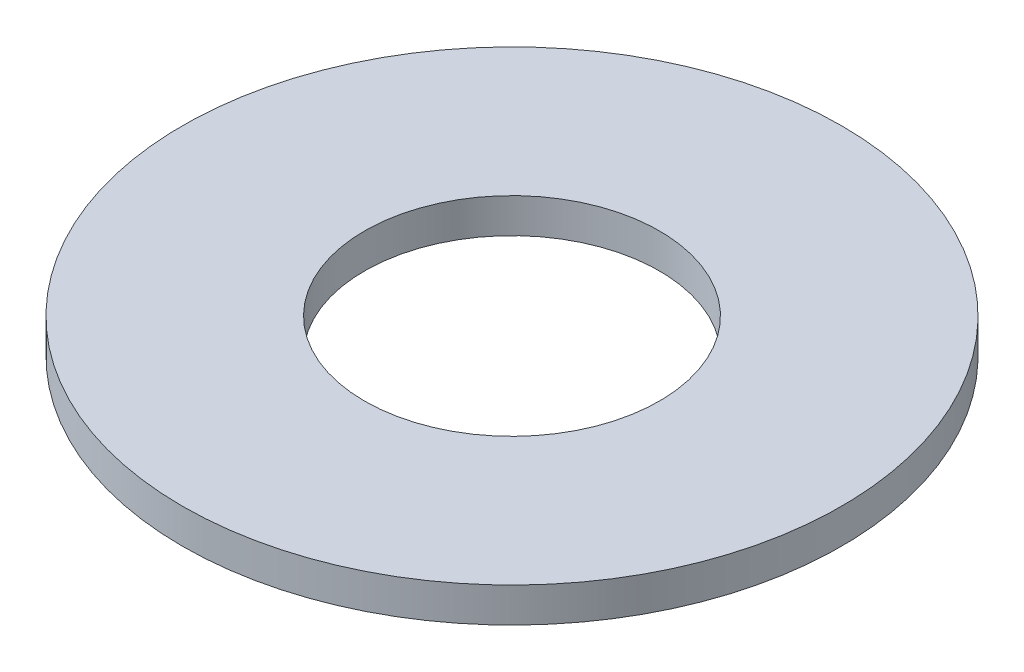
ISO-10303-21;
HEADER;
FILE_DESCRIPTION(('STEP AP214'),'2;1');
FILE_NAME('part.step','',(''),(''),'','','');
FILE_SCHEMA(('AUTOMOTIVE_DESIGN { 1 0 10303 214 1 1 1 1 }'));
ENDSEC;
DATA;
#1=APPLICATION_CONTEXT('core data for automotive mechanical design processes');
#2=APPLICATION_PROTOCOL_DEFINITION('international standard','automotive_design',2000,#1);
#3=PRODUCT_CONTEXT('',#1,'mechanical');
#4=PRODUCT('Part','Part','',(#3));
#5=PRODUCT_RELATED_PRODUCT_CATEGORY('part','',(#4));
#6=PRODUCT_DEFINITION_FORMATION('','',#4);
#7=PRODUCT_DEFINITION_CONTEXT('part definition',#1,'design');
#8=PRODUCT_DEFINITION('design','',#6,#7);
#9=PRODUCT_DEFINITION_SHAPE('','',#8);
#10=(LENGTH_UNIT() NAMED_UNIT(*) SI_UNIT(.MILLI.,.METRE.));
#11=(NAMED_UNIT(*) PLANE_ANGLE_UNIT() SI_UNIT($,.RADIAN.));
#12=(NAMED_UNIT(*) SI_UNIT($,.STERADIAN.) SOLID_ANGLE_UNIT());
#13=UNCERTAINTY_MEASURE_WITH_UNIT(LENGTH_MEASURE(1.E-05),#10,'distance_accuracy_value','');
#14=(GEOMETRIC_REPRESENTATION_CONTEXT(3) GLOBAL_UNCERTAINTY_ASSIGNED_CONTEXT((#13)) GLOBAL_UNIT_ASSIGNED_CONTEXT((#10,
#11,#12)) REPRESENTATION_CONTEXT('',''));
#15=CARTESIAN_POINT('',(0.,0.,0.));
#16=DIRECTION('',(0.,0.,1.));
#17=DIRECTION('',(1.,0.,0.));
#18=AXIS2_PLACEMENT_3D('',#15,#16,#17);
#19=CARTESIAN_POINT('',(0.,0.508,0.));
#20=DIRECTION('',(0.,1.,0.));
#21=DIRECTION('',(0.,0.,1.));
#22=AXIS2_PLACEMENT_3D('',#19,#20,#21);
#23=PLANE('',#22);
#24=CARTESIAN_POINT('',(0.,0.508,0.));
#25=DIRECTION('',(0.,1.,0.));
#26=DIRECTION('',(0.,0.,1.));
#27=AXIS2_PLACEMENT_3D('',#24,#25,#26);
#28=CIRCLE('',#27,4.826);
#29=CARTESIAN_POINT('',(0.,0.508,4.826));
#30=VERTEX_POINT('',#29);
#31=EDGE_CURVE('E10',#30,#30,#28,.T.);
#32=ORIENTED_EDGE('',*,*,#31,.T.);
#33=EDGE_LOOP('',(#32));
#34=FACE_BOUND('',#33,.T.);
#35=CARTESIAN_POINT('',(0.,0.508,0.));
#36=DIRECTION('',(0.,1.,0.));
#37=DIRECTION('',(0.,0.,1.));
#38=AXIS2_PLACEMENT_3D('',#35,#36,#37);
#39=CIRCLE('',#38,2.159);
#40=CARTESIAN_POINT('',(0.,0.508,2.159));
#41=VERTEX_POINT('',#40);
#42=EDGE_CURVE('E42',#41,#41,#39,.T.);
#43=ORIENTED_EDGE('',*,*,#42,.F.);
#44=EDGE_LOOP('',(#43));
#45=FACE_BOUND('',#44,.T.);
#46=ADVANCED_FACE('F31',(#34,#45),#23,.T.);
#47=CARTESIAN_POINT('',(0.,0.,0.));
#48=DIRECTION('',(0.,1.,0.));
#49=DIRECTION('',(0.,0.,1.));
#50=AXIS2_PLACEMENT_3D('',#47,#48,#49);
#51=PLANE('',#50);
#52=CARTESIAN_POINT('',(0.,0.,0.));
#53=DIRECTION('',(0.,1.,0.));
#54=DIRECTION('',(0.,0.,1.));
#55=AXIS2_PLACEMENT_3D('',#52,#53,#54);
#56=CIRCLE('',#55,4.826);
#57=CARTESIAN_POINT('',(0.,0.,4.826));
#58=VERTEX_POINT('',#57);
#59=EDGE_CURVE('E35',#58,#58,#56,.T.);
#60=ORIENTED_EDGE('',*,*,#59,.F.);
#61=EDGE_LOOP('',(#60));
#62=FACE_BOUND('',#61,.T.);
#63=CARTESIAN_POINT('',(0.,0.,0.));
#64=DIRECTION('',(0.,1.,0.));
#65=DIRECTION('',(0.,0.,1.));
#66=AXIS2_PLACEMENT_3D('',#63,#64,#65);
#67=CIRCLE('',#66,2.159);
#68=CARTESIAN_POINT('',(0.,0.,2.159));
#69=VERTEX_POINT('',#68);
#70=EDGE_CURVE('E44',#69,#69,#67,.T.);
#71=ORIENTED_EDGE('',*,*,#70,.T.);
#72=EDGE_LOOP('',(#71));
#73=FACE_BOUND('',#72,.T.);
#74=ADVANCED_FACE('F54',(#62,#73),#51,.F.);
#75=CARTESIAN_POINT('',(0.,0.508,0.));
#76=DIRECTION('',(0.,-1.,0.));
#77=DIRECTION('',(0.,0.,-1.));
#78=AXIS2_PLACEMENT_3D('',#75,#76,#77);
#79=CYLINDRICAL_SURFACE('',#78,4.826);
#80=ORIENTED_EDGE('',*,*,#31,.F.);
#81=EDGE_LOOP('',(#80));
#82=FACE_BOUND('',#81,.T.);
#83=ORIENTED_EDGE('',*,*,#59,.T.);
#84=EDGE_LOOP('',(#83));
#85=FACE_BOUND('',#84,.T.);
#86=ADVANCED_FACE('F33',(#82,#85),#79,.T.);
#87=CARTESIAN_POINT('',(0.,0.508,0.));
#88=DIRECTION('',(0.,-1.,0.));
#89=DIRECTION('',(0.,0.,-1.));
#90=AXIS2_PLACEMENT_3D('',#87,#88,#89);
#91=CYLINDRICAL_SURFACE('',#90,2.159);
#92=ORIENTED_EDGE('',*,*,#42,.T.);
#93=EDGE_LOOP('',(#92));
#94=FACE_BOUND('',#93,.T.);
#95=ORIENTED_EDGE('',*,*,#70,.F.);
#96=EDGE_LOOP('',(#95));
#97=FACE_BOUND('',#96,.T.);
#98=ADVANCED_FACE('F50',(#94,#97),#91,.F.);
#99=CLOSED_SHELL('',(#46,#74,#86,#98));
#100=MANIFOLD_SOLID_BREP('B2',#99);
#101=ADVANCED_BREP_SHAPE_REPRESENTATION('',(#18,#100),#14);
#102=SHAPE_DEFINITION_REPRESENTATION(#9,#101);
ENDSEC;
END-ISO-10303-21;
